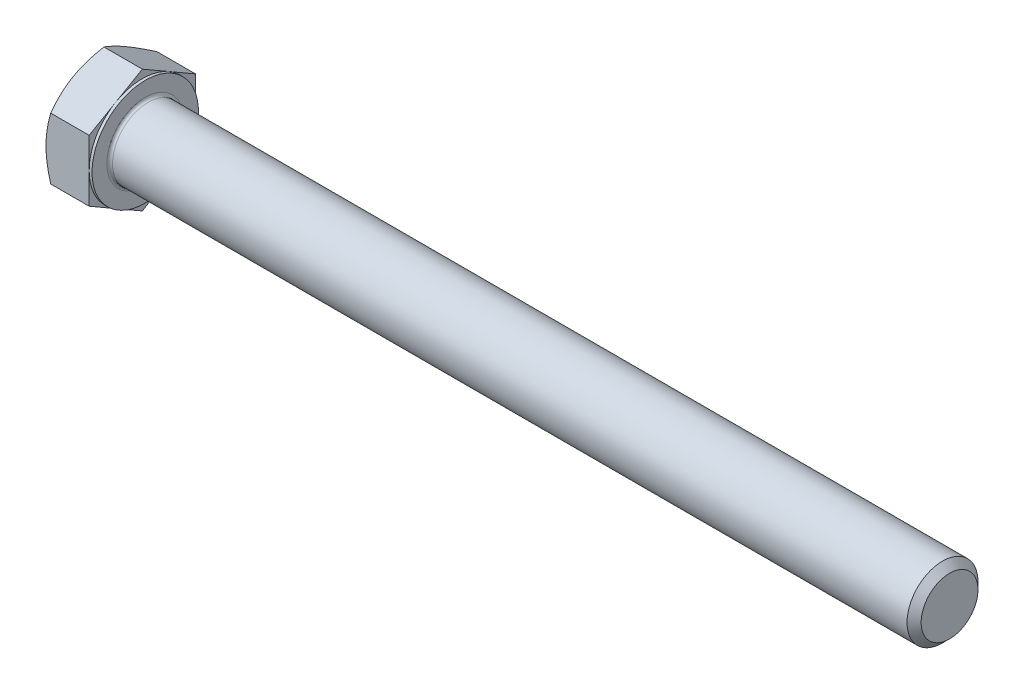
ISO-10303-21;
HEADER;
FILE_DESCRIPTION(('STEP AP214'),'2;1');
FILE_NAME('part.step','',(''),(''),'','','');
FILE_SCHEMA(('AUTOMOTIVE_DESIGN { 1 0 10303 214 1 1 1 1 }'));
ENDSEC;
DATA;
#1=APPLICATION_CONTEXT('core data for automotive mechanical design processes');
#2=APPLICATION_PROTOCOL_DEFINITION('international standard','automotive_design',2000,#1);
#3=PRODUCT_CONTEXT('',#1,'mechanical');
#4=PRODUCT('Part','Part','',(#3));
#5=PRODUCT_RELATED_PRODUCT_CATEGORY('part','',(#4));
#6=PRODUCT_DEFINITION_FORMATION('','',#4);
#7=PRODUCT_DEFINITION_CONTEXT('part definition',#1,'design');
#8=PRODUCT_DEFINITION('design','',#6,#7);
#9=PRODUCT_DEFINITION_SHAPE('','',#8);
#10=(LENGTH_UNIT() NAMED_UNIT(*) SI_UNIT(.MILLI.,.METRE.));
#11=(NAMED_UNIT(*) PLANE_ANGLE_UNIT() SI_UNIT($,.RADIAN.));
#12=(NAMED_UNIT(*) SI_UNIT($,.STERADIAN.) SOLID_ANGLE_UNIT());
#13=UNCERTAINTY_MEASURE_WITH_UNIT(LENGTH_MEASURE(1.E-05),#10,'distance_accuracy_value','');
#14=(GEOMETRIC_REPRESENTATION_CONTEXT(3) GLOBAL_UNCERTAINTY_ASSIGNED_CONTEXT((#13)) GLOBAL_UNIT_ASSIGNED_CONTEXT((#10,
#11,#12)) REPRESENTATION_CONTEXT('',''));
#15=CARTESIAN_POINT('',(0.,0.,0.));
#16=DIRECTION('',(0.,0.,1.));
#17=DIRECTION('',(1.,0.,0.));
#18=AXIS2_PLACEMENT_3D('',#15,#16,#17);
#19=CARTESIAN_POINT('',(0.,8.24155962262808,0.));
#20=DIRECTION('',(1.,0.,0.));
#21=DIRECTION('',(0.,0.,-1.));
#22=AXIS2_PLACEMENT_3D('',#19,#20,#21);
#23=PLANE('',#22);
#24=CARTESIAN_POINT('',(0.,0.,0.));
#25=DIRECTION('',(1.,0.,0.));
#26=DIRECTION('',(0.,0.,-1.));
#27=AXIS2_PLACEMENT_3D('',#24,#25,#26);
#28=CIRCLE('',#27,7.1374);
#29=CARTESIAN_POINT('',(0.,-6.18116971697105,-3.56870000000001));
#30=VERTEX_POINT('',#29);
#31=CARTESIAN_POINT('',(0.,0.,-7.1374));
#32=VERTEX_POINT('',#31);
#33=EDGE_CURVE('E111',#30,#32,#28,.T.);
#34=ORIENTED_EDGE('',*,*,#33,.F.);
#35=CARTESIAN_POINT('',(0.,0.,0.));
#36=DIRECTION('',(1.,0.,0.));
#37=DIRECTION('',(0.,0.,-1.));
#38=AXIS2_PLACEMENT_3D('',#35,#36,#37);
#39=CIRCLE('',#38,7.1374);
#40=CARTESIAN_POINT('',(0.,-6.18116971697106,3.56870000000001));
#41=VERTEX_POINT('',#40);
#42=EDGE_CURVE('E108',#41,#30,#39,.T.);
#43=ORIENTED_EDGE('',*,*,#42,.F.);
#44=CARTESIAN_POINT('',(0.,0.,0.));
#45=DIRECTION('',(1.,0.,0.));
#46=DIRECTION('',(0.,0.,-1.));
#47=AXIS2_PLACEMENT_3D('',#44,#45,#46);
#48=CIRCLE('',#47,7.1374);
#49=CARTESIAN_POINT('',(0.,0.,7.1374));
#50=VERTEX_POINT('',#49);
#51=EDGE_CURVE('E423',#50,#41,#48,.T.);
#52=ORIENTED_EDGE('',*,*,#51,.F.);
#53=CARTESIAN_POINT('',(0.,0.,0.));
#54=DIRECTION('',(1.,0.,0.));
#55=DIRECTION('',(0.,0.,-1.));
#56=AXIS2_PLACEMENT_3D('',#53,#54,#55);
#57=CIRCLE('',#56,7.1374);
#58=CARTESIAN_POINT('',(0.,6.18116971697105,3.56870000000001));
#59=VERTEX_POINT('',#58);
#60=EDGE_CURVE('E169',#59,#50,#57,.T.);
#61=ORIENTED_EDGE('',*,*,#60,.F.);
#62=CARTESIAN_POINT('',(0.,0.,0.));
#63=DIRECTION('',(1.,0.,0.));
#64=DIRECTION('',(0.,0.,-1.));
#65=AXIS2_PLACEMENT_3D('',#62,#63,#64);
#66=CIRCLE('',#65,7.1374);
#67=CARTESIAN_POINT('',(0.,6.18116971697105,-3.56870000000001));
#68=VERTEX_POINT('',#67);
#69=EDGE_CURVE('E421',#68,#59,#66,.T.);
#70=ORIENTED_EDGE('',*,*,#69,.F.);
#71=CARTESIAN_POINT('',(0.,0.,0.));
#72=DIRECTION('',(1.,0.,0.));
#73=DIRECTION('',(0.,0.,-1.));
#74=AXIS2_PLACEMENT_3D('',#71,#72,#73);
#75=CIRCLE('',#74,7.1374);
#76=EDGE_CURVE('E114',#32,#68,#75,.T.);
#77=ORIENTED_EDGE('',*,*,#76,.F.);
#78=EDGE_LOOP('',(#34,#43,#52,#61,#70,#77));
#79=FACE_BOUND('',#78,.T.);
#80=ADVANCED_FACE('F14',(#79),#23,.F.);
#81=CARTESIAN_POINT('',(0.641311776484754,0.,0.));
#82=DIRECTION('',(1.,0.,0.));
#83=DIRECTION('',(0.,0.,-1.));
#84=AXIS2_PLACEMENT_3D('',#81,#82,#83);
#85=CONICAL_SURFACE('',#84,8.24818458036387,1.0471975511966);
#86=ORIENTED_EDGE('',*,*,#42,.T.);
#87=CARTESIAN_POINT('',(0.,-6.18116971697106,-3.56870000000002));
#88=CARTESIAN_POINT('',(-2.91702878281906E-05,-6.26862170985652,-3.41722870509925));
#89=CARTESIAN_POINT('',(0.00371114889844038,-6.35606948988297,-3.26576470708432));
#90=CARTESIAN_POINT('',(0.0185139577467835,-6.53079334497843,-2.9631341127647));
#91=CARTESIAN_POINT('',(0.0295749978503088,-6.61806945060963,-2.81196746352471));
#92=CARTESIAN_POINT('',(0.0587296036169501,-6.7918862225359,-2.5109079833408));
#93=CARTESIAN_POINT('',(0.0767877659737066,-6.87842838481195,-2.3610125612818));
#94=CARTESIAN_POINT('',(0.119548178265526,-7.05110039256495,-2.06193587080869));
#95=CARTESIAN_POINT('',(0.144250603082628,-7.13723022712836,-1.91275462129736));
#96=CARTESIAN_POINT('',(0.227561148311189,-7.39464422393007,-1.46690050025742));
#97=CARTESIAN_POINT('',(0.295412992760169,-7.56518058886256,-1.17152285165624));
#98=CARTESIAN_POINT('',(0.451896700790797,-7.90478678087675,-0.583307672522674));
#99=CARTESIAN_POINT('',(0.540632343376944,-8.07384476218822,-0.290490659466179));
#100=CARTESIAN_POINT('',(0.637486855352638,-8.2415596226281,0.));
#101=B_SPLINE_CURVE_WITH_KNOTS('',3,(#87,#88,#89,#90,#91,#92,#93,#94,#95,#96,#97,#98,#99,#100),
.UNSPECIFIED.,.F.,.F.,(4,2,2,2,2,2,4),(0.,0.524658409500519,1.04921296370403,1.5711473776056,
2.09309553056225,3.13562382142666,4.18344647054619),.UNSPECIFIED.);
#102=CARTESIAN_POINT('',(0.637486855352637,-8.2415596226281,0.));
#103=VERTEX_POINT('',#102);
#104=EDGE_CURVE('E126',#30,#103,#101,.T.);
#105=ORIENTED_EDGE('',*,*,#104,.T.);
#106=CARTESIAN_POINT('',(0.637486855352637,-8.2415596226281,0.));
#107=CARTESIAN_POINT('',(0.540632343376944,-8.07384476218822,0.290490659466181));
#108=CARTESIAN_POINT('',(0.451896700790797,-7.90478678087675,0.583307672522676));
#109=CARTESIAN_POINT('',(0.295412992760169,-7.56518058886257,1.17152285165624));
#110=CARTESIAN_POINT('',(0.227561148311189,-7.39464422393008,1.46690050025742));
#111=CARTESIAN_POINT('',(0.14425060308263,-7.13723022712836,1.91275462129736));
#112=CARTESIAN_POINT('',(0.119548178265528,-7.05110039256495,2.06193587080869));
#113=CARTESIAN_POINT('',(0.0767877659737086,-6.87842838481196,2.3610125612818));
#114=CARTESIAN_POINT('',(0.0587296036169518,-6.7918862225359,2.5109079833408));
#115=CARTESIAN_POINT('',(0.0295749978503104,-6.61806945060963,2.81196746352471));
#116=CARTESIAN_POINT('',(0.0185139577467855,-6.53079334497843,2.9631341127647));
#117=CARTESIAN_POINT('',(0.00371114889844278,-6.35606948988298,3.26576470708432));
#118=CARTESIAN_POINT('',(-2.91702878256121E-05,-6.26862170985652,3.41722870509925));
#119=CARTESIAN_POINT('',(0.,-6.18116971697107,3.56870000000002));
#120=B_SPLINE_CURVE_WITH_KNOTS('',3,(#106,#107,#108,#109,#110,#111,#112,#113,#114,#115,#116,
#117,#118,#119),.UNSPECIFIED.,.F.,.F.,(4,2,2,2,2,2,4),(0.,1.04782264911953,2.09035093998394,
2.61229909294058,3.13423350684215,3.65878806104566,4.18344647054618),.UNSPECIFIED.);
#121=EDGE_CURVE('E132',#103,#41,#120,.T.);
#122=ORIENTED_EDGE('',*,*,#121,.T.);
#123=EDGE_LOOP('',(#86,#105,#122));
#124=FACE_BOUND('',#123,.T.);
#125=ADVANCED_FACE('F130',(#124),#85,.T.);
#126=CARTESIAN_POINT('',(0.641311776484743,0.,0.));
#127=DIRECTION('',(1.,0.,0.));
#128=DIRECTION('',(0.,0.,-1.));
#129=AXIS2_PLACEMENT_3D('',#126,#127,#128);
#130=CONICAL_SURFACE('',#129,8.24818458036385,1.0471975511966);
#131=ORIENTED_EDGE('',*,*,#33,.T.);
#132=CARTESIAN_POINT('',(0.,0.,-7.1374));
#133=CARTESIAN_POINT('',(-2.91702878363875E-05,-0.174903985770917,-7.1374));
#134=CARTESIAN_POINT('',(0.0037111488984321,-0.349799545823828,-7.1374));
#135=CARTESIAN_POINT('',(0.0185139577467752,-0.699247256014727,-7.1374));
#136=CARTESIAN_POINT('',(0.0295749978503004,-0.873799467277128,-7.1374));
#137=CARTESIAN_POINT('',(0.0587296036169417,-1.22143301112966,-7.1374));
#138=CARTESIAN_POINT('',(0.0767877659736981,-1.39451733568178,-7.1374));
#139=CARTESIAN_POINT('',(0.119548178265518,-1.73986135118776,-7.1374));
#140=CARTESIAN_POINT('',(0.144250603082619,-1.91212102031459,-7.1374));
#141=CARTESIAN_POINT('',(0.227561148311179,-2.42694901391801,-7.1374));
#142=CARTESIAN_POINT('',(0.295412992760159,-2.76802174378299,-7.1374));
#143=CARTESIAN_POINT('',(0.451896700790786,-3.44723412781136,-7.1374));
#144=CARTESIAN_POINT('',(0.540632343376933,-3.7853500904343,-7.1374));
#145=CARTESIAN_POINT('',(0.637486855352627,-4.12077981131404,-7.1374));
#146=B_SPLINE_CURVE_WITH_KNOTS('',3,(#132,#133,#134,#135,#136,#137,#138,#139,#140,#141,#142,
#143,#144,#145),.UNSPECIFIED.,.F.,.F.,(4,2,2,2,2,2,4),(0.,0.524658409500517,1.04921296370403,
1.5711473776056,2.09309553056224,3.13562382142665,4.18344647054617),.UNSPECIFIED.);
#147=CARTESIAN_POINT('',(0.637486855352626,-4.12077981131404,-7.1374));
#148=VERTEX_POINT('',#147);
#149=EDGE_CURVE('E122',#32,#148,#146,.T.);
#150=ORIENTED_EDGE('',*,*,#149,.T.);
#151=CARTESIAN_POINT('',(0.637486855352626,-4.12077981131404,-7.1374));
#152=CARTESIAN_POINT('',(0.540632343376933,-4.28849467175391,-6.84690934053382));
#153=CARTESIAN_POINT('',(0.451896700790788,-4.45755265306538,-6.55409232747733));
#154=CARTESIAN_POINT('',(0.295412992760162,-4.79715884507957,-5.96587714834377));
#155=CARTESIAN_POINT('',(0.227561148311183,-4.96769521001206,-5.6704994997426));
#156=CARTESIAN_POINT('',(0.144250603082625,-5.22510920681377,-5.22464537870266));
#157=CARTESIAN_POINT('',(0.119548178265524,-5.31123904137718,-5.07546412919133));
#158=CARTESIAN_POINT('',(0.076787765973705,-5.48391104913017,-4.77638743871822));
#159=CARTESIAN_POINT('',(0.0587296036169484,-5.57045321140623,-4.62649201665922));
#160=CARTESIAN_POINT('',(0.0295749978503076,-5.7442699833325,-4.32543253647532));
#161=CARTESIAN_POINT('',(0.0185139577467831,-5.8315460889637,-4.17426588723533));
#162=CARTESIAN_POINT('',(0.00371114889844091,-6.00626994405915,-3.87163529291571));
#163=CARTESIAN_POINT('',(-2.91702878274496E-05,-6.0937177240856,-3.72017129490078));
#164=CARTESIAN_POINT('',(0.,-6.18116971697106,-3.56870000000002));
#165=B_SPLINE_CURVE_WITH_KNOTS('',3,(#151,#152,#153,#154,#155,#156,#157,#158,#159,#160,#161,
#162,#163,#164),.UNSPECIFIED.,.F.,.F.,(4,2,2,2,2,2,4),(0.,1.04782264911952,2.09035093998392,
2.61229909294056,3.13423350684212,3.65878806104563,4.18344647054614),.UNSPECIFIED.);
#166=EDGE_CURVE('E120',#148,#30,#165,.T.);
#167=ORIENTED_EDGE('',*,*,#166,.T.);
#168=EDGE_LOOP('',(#131,#150,#167));
#169=FACE_BOUND('',#168,.T.);
#170=ADVANCED_FACE('F121',(#169),#130,.T.);
#171=CARTESIAN_POINT('',(0.641311776484739,0.,0.));
#172=DIRECTION('',(1.,0.,0.));
#173=DIRECTION('',(0.,0.,-1.));
#174=AXIS2_PLACEMENT_3D('',#171,#172,#173);
#175=CONICAL_SURFACE('',#174,8.24818458036384,1.0471975511966);
#176=CARTESIAN_POINT('',(0.637486855352624,4.12077981131404,-7.1374));
#177=CARTESIAN_POINT('',(0.540632343376931,3.78535009043429,-7.1374));
#178=CARTESIAN_POINT('',(0.451896700790785,3.44723412781136,-7.1374));
#179=CARTESIAN_POINT('',(0.295412992760157,2.76802174378299,-7.1374));
#180=CARTESIAN_POINT('',(0.227561148311177,2.42694901391801,-7.1374));
#181=CARTESIAN_POINT('',(0.144250603082619,1.91212102031458,-7.1374));
#182=CARTESIAN_POINT('',(0.119548178265517,1.73986135118776,-7.1374));
#183=CARTESIAN_POINT('',(0.076787765973698,1.39451733568178,-7.1374));
#184=CARTESIAN_POINT('',(0.0587296036169412,1.22143301112966,-7.1374));
#185=CARTESIAN_POINT('',(0.0295749978502998,0.873799467277126,-7.1374));
#186=CARTESIAN_POINT('',(0.018513957746775,0.699247256014726,-7.1374));
#187=CARTESIAN_POINT('',(0.0037111488984325,0.349799545823827,-7.1374));
#188=CARTESIAN_POINT('',(-2.91702878357943E-05,0.174903985770916,-7.1374));
#189=CARTESIAN_POINT('',(0.,0.,-7.1374));
#190=B_SPLINE_CURVE_WITH_KNOTS('',3,(#176,#177,#178,#179,#180,#181,#182,#183,#184,#185,#186,
#187,#188,#189),.UNSPECIFIED.,.F.,.F.,(4,2,2,2,2,2,4),(0.,1.04782264911952,2.09035093998393,
2.61229909294057,3.13423350684214,3.65878806104565,4.18344647054616),.UNSPECIFIED.);
#191=CARTESIAN_POINT('',(0.637486855352624,4.12077981131404,-7.1374));
#192=VERTEX_POINT('',#191);
#193=EDGE_CURVE('E140',#192,#32,#190,.T.);
#194=ORIENTED_EDGE('',*,*,#193,.T.);
#195=ORIENTED_EDGE('',*,*,#76,.T.);
#196=CARTESIAN_POINT('',(0.,6.18116971697105,-3.56870000000001));
#197=CARTESIAN_POINT('',(-2.9170287832926E-05,6.0937177240856,-3.72017129490077));
#198=CARTESIAN_POINT('',(0.00371114889843545,6.00626994405914,-3.8716352929157));
#199=CARTESIAN_POINT('',(0.018513957746778,5.83154608896369,-4.17426588723532));
#200=CARTESIAN_POINT('',(0.0295749978503029,5.74426998333249,-4.32543253647531));
#201=CARTESIAN_POINT('',(0.0587296036169437,5.57045321140622,-4.62649201665922));
#202=CARTESIAN_POINT('',(0.0767877659737001,5.48391104913017,-4.77638743871822));
#203=CARTESIAN_POINT('',(0.119548178265519,5.31123904137718,-5.07546412919132));
#204=CARTESIAN_POINT('',(0.144250603082621,5.22510920681376,-5.22464537870265));
#205=CARTESIAN_POINT('',(0.22756114831118,4.96769521001205,-5.67049949974259));
#206=CARTESIAN_POINT('',(0.295412992760159,4.79715884507956,-5.96587714834377));
#207=CARTESIAN_POINT('',(0.451896700790785,4.45755265306538,-6.55409232747733));
#208=CARTESIAN_POINT('',(0.540632343376931,4.28849467175391,-6.84690934053382));
#209=CARTESIAN_POINT('',(0.637486855352624,4.12077981131404,-7.1374));
#210=B_SPLINE_CURVE_WITH_KNOTS('',3,(#196,#197,#198,#199,#200,#201,#202,#203,#204,#205,#206,
#207,#208,#209),.UNSPECIFIED.,.F.,.F.,(4,2,2,2,2,2,4),(0.,0.524658409500515,1.04921296370402,
1.57114737760559,2.09309553056223,3.13562382142663,4.18344647054615),.UNSPECIFIED.);
#211=EDGE_CURVE('E246',#68,#192,#210,.T.);
#212=ORIENTED_EDGE('',*,*,#211,.T.);
#213=EDGE_LOOP('',(#194,#195,#212));
#214=FACE_BOUND('',#213,.T.);
#215=ADVANCED_FACE('F236',(#214),#175,.T.);
#216=CARTESIAN_POINT('',(0.641311776484745,0.,0.));
#217=DIRECTION('',(1.,0.,0.));
#218=DIRECTION('',(0.,0.,-1.));
#219=AXIS2_PLACEMENT_3D('',#216,#217,#218);
#220=CONICAL_SURFACE('',#219,8.24818458036385,1.0471975511966);
#221=CARTESIAN_POINT('',(0.637486855352629,8.24155962262808,0.));
#222=CARTESIAN_POINT('',(0.540632343376936,8.07384476218821,-0.290490659466181));
#223=CARTESIAN_POINT('',(0.45189670079079,7.90478678087674,-0.583307672522675));
#224=CARTESIAN_POINT('',(0.295412992760162,7.56518058886255,-1.17152285165624));
#225=CARTESIAN_POINT('',(0.227561148311182,7.39464422393006,-1.46690050025742));
#226=CARTESIAN_POINT('',(0.144250603082622,7.13723022712835,-1.91275462129736));
#227=CARTESIAN_POINT('',(0.119548178265521,7.05110039256494,-2.06193587080869));
#228=CARTESIAN_POINT('',(0.076787765973701,6.87842838481194,-2.3610125612818));
#229=CARTESIAN_POINT('',(0.0587296036169442,6.79188622253589,-2.5109079833408));
#230=CARTESIAN_POINT('',(0.0295749978503029,6.61806945060962,-2.81196746352471));
#231=CARTESIAN_POINT('',(0.018513957746778,6.53079334497842,-2.96313411276469));
#232=CARTESIAN_POINT('',(0.00371114889843529,6.35606948988297,-3.26576470708432));
#233=CARTESIAN_POINT('',(-2.91702878331806E-05,6.26862170985651,-3.41722870509924));
#234=CARTESIAN_POINT('',(0.,6.18116971697105,-3.56870000000001));
#235=B_SPLINE_CURVE_WITH_KNOTS('',3,(#221,#222,#223,#224,#225,#226,#227,#228,#229,#230,#231,
#232,#233,#234),.UNSPECIFIED.,.F.,.F.,(4,2,2,2,2,2,4),(0.,1.04782264911952,2.09035093998393,
2.61229909294058,3.13423350684215,3.65878806104566,4.18344647054617),.UNSPECIFIED.);
#236=CARTESIAN_POINT('',(0.637486855352629,8.24155962262808,0.));
#237=VERTEX_POINT('',#236);
#238=EDGE_CURVE('E241',#237,#68,#235,.T.);
#239=ORIENTED_EDGE('',*,*,#238,.T.);
#240=ORIENTED_EDGE('',*,*,#69,.T.);
#241=CARTESIAN_POINT('',(0.,6.18116971697105,3.56870000000001));
#242=CARTESIAN_POINT('',(-2.9170287834756E-05,6.26862170985651,3.41722870509925));
#243=CARTESIAN_POINT('',(0.00371114889843365,6.35606948988296,3.26576470708432));
#244=CARTESIAN_POINT('',(0.018513957746776,6.53079334497841,2.9631341127647));
#245=CARTESIAN_POINT('',(0.0295749978503007,6.61806945060961,2.81196746352471));
#246=CARTESIAN_POINT('',(0.0587296036169419,6.79188622253588,2.5109079833408));
#247=CARTESIAN_POINT('',(0.0767877659736988,6.87842838481194,2.3610125612818));
#248=CARTESIAN_POINT('',(0.119548178265519,7.05110039256493,2.06193587080869));
#249=CARTESIAN_POINT('',(0.14425060308262,7.13723022712835,1.91275462129736));
#250=CARTESIAN_POINT('',(0.22756114831118,7.39464422393006,1.46690050025742));
#251=CARTESIAN_POINT('',(0.295412992760161,7.56518058886255,1.17152285165624));
#252=CARTESIAN_POINT('',(0.451896700790789,7.90478678087674,0.583307672522675));
#253=CARTESIAN_POINT('',(0.540632343376935,8.07384476218821,0.29049065946618));
#254=CARTESIAN_POINT('',(0.637486855352629,8.24155962262808,0.));
#255=B_SPLINE_CURVE_WITH_KNOTS('',3,(#241,#242,#243,#244,#245,#246,#247,#248,#249,#250,#251,
#252,#253,#254),.UNSPECIFIED.,.F.,.F.,(4,2,2,2,2,2,4),(0.,0.524658409500518,1.04921296370403,
1.5711473776056,2.09309553056224,3.13562382142665,4.18344647054618),.UNSPECIFIED.);
#256=EDGE_CURVE('E228',#59,#237,#255,.T.);
#257=ORIENTED_EDGE('',*,*,#256,.T.);
#258=EDGE_LOOP('',(#239,#240,#257));
#259=FACE_BOUND('',#258,.T.);
#260=ADVANCED_FACE('F233',(#259),#220,.T.);
#261=CARTESIAN_POINT('',(0.641311776484745,0.,0.));
#262=DIRECTION('',(1.,0.,0.));
#263=DIRECTION('',(0.,0.,-1.));
#264=AXIS2_PLACEMENT_3D('',#261,#262,#263);
#265=CONICAL_SURFACE('',#264,8.24818458036385,1.0471975511966);
#266=ORIENTED_EDGE('',*,*,#51,.T.);
#267=CARTESIAN_POINT('',(0.,-6.18116971697107,3.56870000000002));
#268=CARTESIAN_POINT('',(-2.9170287825595E-05,-6.09371772408561,3.72017129490078));
#269=CARTESIAN_POINT('',(0.00371114889844298,-6.00626994405915,3.87163529291571));
#270=CARTESIAN_POINT('',(0.0185139577467859,-5.8315460889637,4.17426588723533));
#271=CARTESIAN_POINT('',(0.0295749978503109,-5.7442699833325,4.32543253647531));
#272=CARTESIAN_POINT('',(0.0587296036169516,-5.57045321140624,4.62649201665922));
#273=CARTESIAN_POINT('',(0.0767877659737078,-5.48391104913018,4.77638743871822));
#274=CARTESIAN_POINT('',(0.119548178265527,-5.31123904137719,5.07546412919133));
#275=CARTESIAN_POINT('',(0.144250603082628,-5.22510920681378,5.22464537870266));
#276=CARTESIAN_POINT('',(0.227561148311187,-4.96769521001206,5.6704994997426));
#277=CARTESIAN_POINT('',(0.295412992760166,-4.79715884507958,5.96587714834377));
#278=CARTESIAN_POINT('',(0.451896700790791,-4.45755265306539,6.55409232747733));
#279=CARTESIAN_POINT('',(0.540632343376936,-4.28849467175392,6.84690934053382));
#280=CARTESIAN_POINT('',(0.637486855352629,-4.12077981131405,7.1374));
#281=B_SPLINE_CURVE_WITH_KNOTS('',3,(#267,#268,#269,#270,#271,#272,#273,#274,#275,#276,#277,
#278,#279,#280),.UNSPECIFIED.,.F.,.F.,(4,2,2,2,2,2,4),(0.,0.524658409500513,1.04921296370402,
1.57114737760559,2.09309553056223,3.13562382142663,4.18344647054615),.UNSPECIFIED.);
#282=CARTESIAN_POINT('',(0.637486855352629,-4.12077981131405,7.1374));
#283=VERTEX_POINT('',#282);
#284=EDGE_CURVE('E127',#41,#283,#281,.T.);
#285=ORIENTED_EDGE('',*,*,#284,.T.);
#286=CARTESIAN_POINT('',(0.637486855352629,-4.12077981131405,7.1374));
#287=CARTESIAN_POINT('',(0.540632343376935,-3.78535009043431,7.1374));
#288=CARTESIAN_POINT('',(0.451896700790788,-3.44723412781137,7.1374));
#289=CARTESIAN_POINT('',(0.29541299276016,-2.768021743783,7.1374));
#290=CARTESIAN_POINT('',(0.22756114831118,-2.42694901391802,7.1374));
#291=CARTESIAN_POINT('',(0.14425060308262,-1.91212102031459,7.1374));
#292=CARTESIAN_POINT('',(0.119548178265519,-1.73986135118776,7.1374));
#293=CARTESIAN_POINT('',(0.0767877659736989,-1.39451733568178,7.1374));
#294=CARTESIAN_POINT('',(0.0587296036169421,-1.22143301112967,7.1374));
#295=CARTESIAN_POINT('',(0.0295749978503008,-0.87379946727713,7.1374));
#296=CARTESIAN_POINT('',(0.018513957746776,-0.699247256014728,7.1374));
#297=CARTESIAN_POINT('',(0.00371114889843334,-0.349799545823828,7.1374));
#298=CARTESIAN_POINT('',(-2.91702878350887E-05,-0.174903985770916,7.1374));
#299=CARTESIAN_POINT('',(0.,0.,7.1374));
#300=B_SPLINE_CURVE_WITH_KNOTS('',3,(#286,#287,#288,#289,#290,#291,#292,#293,#294,#295,#296,
#297,#298,#299),.UNSPECIFIED.,.F.,.F.,(4,2,2,2,2,2,4),(0.,1.04782264911953,2.09035093998394,
2.61229909294058,3.13423350684215,3.65878806104566,4.18344647054618),.UNSPECIFIED.);
#301=EDGE_CURVE('E206',#283,#50,#300,.T.);
#302=ORIENTED_EDGE('',*,*,#301,.T.);
#303=EDGE_LOOP('',(#266,#285,#302));
#304=FACE_BOUND('',#303,.T.);
#305=ADVANCED_FACE('F184',(#304),#265,.T.);
#306=CARTESIAN_POINT('',(0.641311776484738,0.,0.));
#307=DIRECTION('',(1.,0.,0.));
#308=DIRECTION('',(0.,0.,-1.));
#309=AXIS2_PLACEMENT_3D('',#306,#307,#308);
#310=CONICAL_SURFACE('',#309,8.24818458036384,1.0471975511966);
#311=CARTESIAN_POINT('',(0.637486855352622,4.12077981131403,7.1374));
#312=CARTESIAN_POINT('',(0.540632343376929,4.2884946717539,6.84690934053382));
#313=CARTESIAN_POINT('',(0.451896700790783,4.45755265306537,6.55409232747733));
#314=CARTESIAN_POINT('',(0.295412992760157,4.79715884507955,5.96587714834377));
#315=CARTESIAN_POINT('',(0.227561148311178,4.96769521001204,5.67049949974259));
#316=CARTESIAN_POINT('',(0.144250603082619,5.22510920681376,5.22464537870266));
#317=CARTESIAN_POINT('',(0.119548178265518,5.31123904137717,5.07546412919132));
#318=CARTESIAN_POINT('',(0.0767877659736985,5.48391104913016,4.77638743871822));
#319=CARTESIAN_POINT('',(0.0587296036169418,5.57045321140622,4.62649201665922));
#320=CARTESIAN_POINT('',(0.0295749978503007,5.74426998333248,4.32543253647531));
#321=CARTESIAN_POINT('',(0.0185139577467759,5.83154608896368,4.17426588723532));
#322=CARTESIAN_POINT('',(0.00371114889843337,6.00626994405913,3.8716352929157));
#323=CARTESIAN_POINT('',(-2.91702878350612E-05,6.09371772408559,3.72017129490078));
#324=CARTESIAN_POINT('',(0.,6.18116971697105,3.56870000000001));
#325=B_SPLINE_CURVE_WITH_KNOTS('',3,(#311,#312,#313,#314,#315,#316,#317,#318,#319,#320,#321,
#322,#323,#324),.UNSPECIFIED.,.F.,.F.,(4,2,2,2,2,2,4),(0.,1.04782264911952,2.09035093998392,
2.61229909294056,3.13423350684213,3.65878806104564,4.18344647054615),.UNSPECIFIED.);
#326=CARTESIAN_POINT('',(0.637486855352622,4.12077981131403,7.1374));
#327=VERTEX_POINT('',#326);
#328=EDGE_CURVE('E190',#327,#59,#325,.T.);
#329=ORIENTED_EDGE('',*,*,#328,.T.);
#330=ORIENTED_EDGE('',*,*,#60,.T.);
#331=CARTESIAN_POINT('',(0.,0.,7.1374));
#332=CARTESIAN_POINT('',(-2.91702878350349E-05,0.174903985770917,7.1374));
#333=CARTESIAN_POINT('',(0.00371114889843339,0.349799545823827,7.1374));
#334=CARTESIAN_POINT('',(0.0185139577467758,0.699247256014725,7.1374));
#335=CARTESIAN_POINT('',(0.0295749978503005,0.873799467277125,7.1374));
#336=CARTESIAN_POINT('',(0.0587296036169414,1.22143301112966,7.1374));
#337=CARTESIAN_POINT('',(0.076787765973698,1.39451733568177,7.1374));
#338=CARTESIAN_POINT('',(0.119548178265517,1.73986135118775,7.1374));
#339=CARTESIAN_POINT('',(0.144250603082619,1.91212102031458,7.1374));
#340=CARTESIAN_POINT('',(0.227561148311177,2.426949013918,7.1374));
#341=CARTESIAN_POINT('',(0.295412992760157,2.76802174378298,7.1374));
#342=CARTESIAN_POINT('',(0.451896700790783,3.44723412781135,7.1374));
#343=CARTESIAN_POINT('',(0.540632343376929,3.78535009043429,7.1374));
#344=CARTESIAN_POINT('',(0.637486855352622,4.12077981131403,7.1374));
#345=B_SPLINE_CURVE_WITH_KNOTS('',3,(#331,#332,#333,#334,#335,#336,#337,#338,#339,#340,#341,
#342,#343,#344),.UNSPECIFIED.,.F.,.F.,(4,2,2,2,2,2,4),(0.,0.524658409500515,1.04921296370402,
1.57114737760559,2.09309553056223,3.13562382142663,4.18344647054615),.UNSPECIFIED.);
#346=EDGE_CURVE('E198',#50,#327,#345,.T.);
#347=ORIENTED_EDGE('',*,*,#346,.T.);
#348=EDGE_LOOP('',(#329,#330,#347));
#349=FACE_BOUND('',#348,.T.);
#350=ADVANCED_FACE('F179',(#349),#310,.T.);
#351=CARTESIAN_POINT('',(6.1722,-8.2415596226281,0.));
#352=DIRECTION('',(0.,0.866025403784438,-0.500000000000001));
#353=DIRECTION('',(0.,0.500000000000001,0.866025403784438));
#354=AXIS2_PLACEMENT_3D('',#351,#352,#353);
#355=PLANE('',#354);
#356=DIRECTION('',(-1.,0.,0.));
#357=VECTOR('',#356,1.);
#358=CARTESIAN_POINT('',(6.1722,-4.12077981131405,7.1374));
#359=LINE('',#358,#357);
#360=CARTESIAN_POINT('',(5.7912,-4.12077981131405,7.1374));
#361=VERTEX_POINT('',#360);
#362=EDGE_CURVE('E357',#361,#283,#359,.T.);
#363=ORIENTED_EDGE('',*,*,#362,.T.);
#364=ORIENTED_EDGE('',*,*,#284,.F.);
#365=ORIENTED_EDGE('',*,*,#121,.F.);
#366=DIRECTION('',(1.,0.,0.));
#367=VECTOR('',#366,1.);
#368=CARTESIAN_POINT('',(6.1722,-8.2415596226281,0.));
#369=LINE('',#368,#367);
#370=CARTESIAN_POINT('',(5.7912,-8.2415596226281,0.));
#371=VERTEX_POINT('',#370);
#372=EDGE_CURVE('E138',#103,#371,#369,.T.);
#373=ORIENTED_EDGE('',*,*,#372,.T.);
#374=DIRECTION('',(0.,-0.500000000000005,-0.866025403784436));
#375=VECTOR('',#374,1.);
#376=CARTESIAN_POINT('',(5.7912,-6.18116971697105,3.5687));
#377=LINE('',#376,#375);
#378=CARTESIAN_POINT('',(5.7912,-6.18116971697105,3.5687));
#379=VERTEX_POINT('',#378);
#380=EDGE_CURVE('E347',#379,#371,#377,.T.);
#381=ORIENTED_EDGE('',*,*,#380,.F.);
#382=DIRECTION('',(0.,-0.499999999999996,-0.866025403784441));
#383=VECTOR('',#382,1.);
#384=CARTESIAN_POINT('',(5.7912,-4.12077981131405,7.1374));
#385=LINE('',#384,#383);
#386=EDGE_CURVE('E350',#361,#379,#385,.T.);
#387=ORIENTED_EDGE('',*,*,#386,.F.);
#388=EDGE_LOOP('',(#363,#364,#365,#373,#381,#387));
#389=FACE_BOUND('',#388,.T.);
#390=ADVANCED_FACE('F175',(#389),#355,.F.);
#391=CARTESIAN_POINT('',(6.1722,-4.12077981131404,-7.1374));
#392=DIRECTION('',(0.,0.866025403784438,0.500000000000001));
#393=DIRECTION('',(0.,-0.500000000000001,0.866025403784438));
#394=AXIS2_PLACEMENT_3D('',#391,#392,#393);
#395=PLANE('',#394);
#396=ORIENTED_EDGE('',*,*,#372,.F.);
#397=ORIENTED_EDGE('',*,*,#104,.F.);
#398=ORIENTED_EDGE('',*,*,#166,.F.);
#399=DIRECTION('',(1.,0.,0.));
#400=VECTOR('',#399,1.);
#401=CARTESIAN_POINT('',(6.1722,-4.12077981131404,-7.1374));
#402=LINE('',#401,#400);
#403=CARTESIAN_POINT('',(5.7912,-4.12077981131404,-7.1374));
#404=VERTEX_POINT('',#403);
#405=EDGE_CURVE('E247',#148,#404,#402,.T.);
#406=ORIENTED_EDGE('',*,*,#405,.T.);
#407=DIRECTION('',(0.,0.499999999999998,-0.866025403784439));
#408=VECTOR('',#407,1.);
#409=CARTESIAN_POINT('',(5.7912,-6.18116971697105,-3.56870000000001));
#410=LINE('',#409,#408);
#411=CARTESIAN_POINT('',(5.7912,-6.18116971697104,-3.56870000000001));
#412=VERTEX_POINT('',#411);
#413=EDGE_CURVE('E341',#412,#404,#410,.T.);
#414=ORIENTED_EDGE('',*,*,#413,.F.);
#415=DIRECTION('',(0.,0.500000000000005,-0.866025403784436));
#416=VECTOR('',#415,1.);
#417=CARTESIAN_POINT('',(5.7912,-8.2415596226281,0.));
#418=LINE('',#417,#416);
#419=EDGE_CURVE('E344',#371,#412,#418,.T.);
#420=ORIENTED_EDGE('',*,*,#419,.F.);
#421=EDGE_LOOP('',(#396,#397,#398,#406,#414,#420));
#422=FACE_BOUND('',#421,.T.);
#423=ADVANCED_FACE('F136',(#422),#395,.F.);
#424=CARTESIAN_POINT('',(6.1722,4.12077981131404,-7.1374));
#425=DIRECTION('',(0.,0.,1.));
#426=DIRECTION('',(0.,-1.,0.));
#427=AXIS2_PLACEMENT_3D('',#424,#425,#426);
#428=PLANE('',#427);
#429=ORIENTED_EDGE('',*,*,#405,.F.);
#430=ORIENTED_EDGE('',*,*,#149,.F.);
#431=ORIENTED_EDGE('',*,*,#193,.F.);
#432=DIRECTION('',(1.,0.,0.));
#433=VECTOR('',#432,1.);
#434=CARTESIAN_POINT('',(6.1722,4.12077981131404,-7.1374));
#435=LINE('',#434,#433);
#436=CARTESIAN_POINT('',(5.7912,4.12077981131404,-7.1374));
#437=VERTEX_POINT('',#436);
#438=EDGE_CURVE('E361',#192,#437,#435,.T.);
#439=ORIENTED_EDGE('',*,*,#438,.T.);
#440=DIRECTION('',(0.,1.,0.));
#441=VECTOR('',#440,1.);
#442=CARTESIAN_POINT('',(5.7912,7.1374,-7.1374));
#443=LINE('',#442,#441);
#444=CARTESIAN_POINT('',(5.7912,0.,-7.1374));
#445=VERTEX_POINT('',#444);
#446=EDGE_CURVE('E332',#445,#437,#443,.T.);
#447=ORIENTED_EDGE('',*,*,#446,.F.);
#448=DIRECTION('',(0.,1.,0.));
#449=VECTOR('',#448,1.);
#450=CARTESIAN_POINT('',(5.7912,7.1374,-7.1374));
#451=LINE('',#450,#449);
#452=EDGE_CURVE('E338',#404,#445,#451,.T.);
#453=ORIENTED_EDGE('',*,*,#452,.F.);
#454=EDGE_LOOP('',(#429,#430,#431,#439,#447,#453));
#455=FACE_BOUND('',#454,.T.);
#456=ADVANCED_FACE('F254',(#455),#428,.F.);
#457=CARTESIAN_POINT('',(6.1722,4.12077981131404,-7.1374));
#458=DIRECTION('',(0.,-0.866025403784438,0.500000000000001));
#459=DIRECTION('',(0.,-0.500000000000001,-0.866025403784438));
#460=AXIS2_PLACEMENT_3D('',#457,#458,#459);
#461=PLANE('',#460);
#462=ORIENTED_EDGE('',*,*,#438,.F.);
#463=ORIENTED_EDGE('',*,*,#211,.F.);
#464=ORIENTED_EDGE('',*,*,#238,.F.);
#465=DIRECTION('',(1.,0.,0.));
#466=VECTOR('',#465,1.);
#467=CARTESIAN_POINT('',(6.1722,8.24155962262808,0.));
#468=LINE('',#467,#466);
#469=CARTESIAN_POINT('',(5.7912,8.24155962262808,0.));
#470=VERTEX_POINT('',#469);
#471=EDGE_CURVE('E232',#237,#470,#468,.T.);
#472=ORIENTED_EDGE('',*,*,#471,.T.);
#473=DIRECTION('',(0.,0.500000000000002,0.866025403784437));
#474=VECTOR('',#473,1.);
#475=CARTESIAN_POINT('',(5.7912,6.18116971697105,-3.56870000000001));
#476=LINE('',#475,#474);
#477=CARTESIAN_POINT('',(5.7912,6.18116971697105,-3.5687));
#478=VERTEX_POINT('',#477);
#479=EDGE_CURVE('E329',#478,#470,#476,.T.);
#480=ORIENTED_EDGE('',*,*,#479,.F.);
#481=DIRECTION('',(0.,0.5,0.866025403784439));
#482=VECTOR('',#481,1.);
#483=CARTESIAN_POINT('',(5.7912,4.12077981131404,-7.1374));
#484=LINE('',#483,#482);
#485=EDGE_CURVE('E335',#437,#478,#484,.T.);
#486=ORIENTED_EDGE('',*,*,#485,.F.);
#487=EDGE_LOOP('',(#462,#463,#464,#472,#480,#486));
#488=FACE_BOUND('',#487,.T.);
#489=ADVANCED_FACE('F224',(#488),#461,.F.);
#490=CARTESIAN_POINT('',(6.1722,8.24155962262808,0.));
#491=DIRECTION('',(0.,-0.866025403784438,-0.500000000000001));
#492=DIRECTION('',(0.,0.500000000000001,-0.866025403784438));
#493=AXIS2_PLACEMENT_3D('',#490,#491,#492);
#494=PLANE('',#493);
#495=ORIENTED_EDGE('',*,*,#471,.F.);
#496=ORIENTED_EDGE('',*,*,#256,.F.);
#497=ORIENTED_EDGE('',*,*,#328,.F.);
#498=DIRECTION('',(-1.,0.,0.));
#499=VECTOR('',#498,1.);
#500=CARTESIAN_POINT('',(6.1722,4.12077981131403,7.1374));
#501=LINE('',#500,#499);
#502=CARTESIAN_POINT('',(5.7912,4.12077981131403,7.1374));
#503=VERTEX_POINT('',#502);
#504=EDGE_CURVE('E205',#327,#503,#501,.F.);
#505=ORIENTED_EDGE('',*,*,#504,.T.);
#506=DIRECTION('',(0.,-0.500000000000001,0.866025403784438));
#507=VECTOR('',#506,1.);
#508=CARTESIAN_POINT('',(5.7912,6.18116971697105,3.56870000000001));
#509=LINE('',#508,#507);
#510=CARTESIAN_POINT('',(5.7912,6.18116971697104,3.56870000000001));
#511=VERTEX_POINT('',#510);
#512=EDGE_CURVE('E323',#511,#503,#509,.T.);
#513=ORIENTED_EDGE('',*,*,#512,.F.);
#514=DIRECTION('',(0.,-0.500000000000002,0.866025403784438));
#515=VECTOR('',#514,1.);
#516=CARTESIAN_POINT('',(5.7912,8.24155962262808,0.));
#517=LINE('',#516,#515);
#518=EDGE_CURVE('E326',#470,#511,#517,.T.);
#519=ORIENTED_EDGE('',*,*,#518,.F.);
#520=EDGE_LOOP('',(#495,#496,#497,#505,#513,#519));
#521=FACE_BOUND('',#520,.T.);
#522=ADVANCED_FACE('F217',(#521),#494,.F.);
#523=CARTESIAN_POINT('',(6.1722,4.12077981131403,7.1374));
#524=DIRECTION('',(0.,0.,-1.));
#525=DIRECTION('',(-1.,0.,0.));
#526=AXIS2_PLACEMENT_3D('',#523,#524,#525);
#527=PLANE('',#526);
#528=ORIENTED_EDGE('',*,*,#504,.F.);
#529=ORIENTED_EDGE('',*,*,#346,.F.);
#530=ORIENTED_EDGE('',*,*,#301,.F.);
#531=ORIENTED_EDGE('',*,*,#362,.F.);
#532=DIRECTION('',(0.,1.,0.));
#533=VECTOR('',#532,1.);
#534=CARTESIAN_POINT('',(5.7912,7.1374,7.1374));
#535=LINE('',#534,#533);
#536=CARTESIAN_POINT('',(5.7912,0.,7.1374));
#537=VERTEX_POINT('',#536);
#538=EDGE_CURVE('E353',#537,#361,#535,.F.);
#539=ORIENTED_EDGE('',*,*,#538,.F.);
#540=DIRECTION('',(0.,1.,0.));
#541=VECTOR('',#540,1.);
#542=CARTESIAN_POINT('',(5.7912,7.1374,7.1374));
#543=LINE('',#542,#541);
#544=EDGE_CURVE('E315',#503,#537,#543,.F.);
#545=ORIENTED_EDGE('',*,*,#544,.F.);
#546=EDGE_LOOP('',(#528,#529,#530,#531,#539,#545));
#547=FACE_BOUND('',#546,.T.);
#548=ADVANCED_FACE('F212',(#547),#527,.F.);
#549=CARTESIAN_POINT('',(5.7912,7.1374,0.));
#550=DIRECTION('',(1.,0.,0.));
#551=DIRECTION('',(0.,0.,-1.));
#552=AXIS2_PLACEMENT_3D('',#549,#550,#551);
#553=PLANE('',#552);
#554=ORIENTED_EDGE('',*,*,#386,.T.);
#555=CARTESIAN_POINT('',(5.7912,0.,0.));
#556=DIRECTION('',(-1.,0.,0.));
#557=DIRECTION('',(0.,0.,1.));
#558=AXIS2_PLACEMENT_3D('',#555,#556,#557);
#559=CIRCLE('',#558,7.1374);
#560=EDGE_CURVE('E207',#537,#379,#559,.F.);
#561=ORIENTED_EDGE('',*,*,#560,.F.);
#562=ORIENTED_EDGE('',*,*,#538,.T.);
#563=EDGE_LOOP('',(#554,#561,#562));
#564=FACE_BOUND('',#563,.T.);
#565=ADVANCED_FACE('F216',(#564),#553,.T.);
#566=CARTESIAN_POINT('',(5.7912,7.1374,0.));
#567=DIRECTION('',(1.,0.,0.));
#568=DIRECTION('',(0.,0.,-1.));
#569=AXIS2_PLACEMENT_3D('',#566,#567,#568);
#570=PLANE('',#569);
#571=ORIENTED_EDGE('',*,*,#419,.T.);
#572=CARTESIAN_POINT('',(5.7912,0.,0.));
#573=DIRECTION('',(-1.,0.,0.));
#574=DIRECTION('',(0.,0.,1.));
#575=AXIS2_PLACEMENT_3D('',#572,#573,#574);
#576=CIRCLE('',#575,7.1374);
#577=EDGE_CURVE('E381',#379,#412,#576,.F.);
#578=ORIENTED_EDGE('',*,*,#577,.F.);
#579=ORIENTED_EDGE('',*,*,#380,.T.);
#580=EDGE_LOOP('',(#571,#578,#579));
#581=FACE_BOUND('',#580,.T.);
#582=ADVANCED_FACE('F401',(#581),#570,.T.);
#583=CARTESIAN_POINT('',(5.7912,7.1374,0.));
#584=DIRECTION('',(1.,0.,0.));
#585=DIRECTION('',(0.,0.,-1.));
#586=AXIS2_PLACEMENT_3D('',#583,#584,#585);
#587=PLANE('',#586);
#588=ORIENTED_EDGE('',*,*,#452,.T.);
#589=CARTESIAN_POINT('',(5.7912,0.,0.));
#590=DIRECTION('',(-1.,0.,0.));
#591=DIRECTION('',(0.,0.,1.));
#592=AXIS2_PLACEMENT_3D('',#589,#590,#591);
#593=CIRCLE('',#592,7.1374);
#594=EDGE_CURVE('E379',#412,#445,#593,.F.);
#595=ORIENTED_EDGE('',*,*,#594,.F.);
#596=ORIENTED_EDGE('',*,*,#413,.T.);
#597=EDGE_LOOP('',(#588,#595,#596));
#598=FACE_BOUND('',#597,.T.);
#599=ADVANCED_FACE('F404',(#598),#587,.T.);
#600=CARTESIAN_POINT('',(5.7912,7.1374,0.));
#601=DIRECTION('',(1.,0.,0.));
#602=DIRECTION('',(0.,0.,-1.));
#603=AXIS2_PLACEMENT_3D('',#600,#601,#602);
#604=PLANE('',#603);
#605=CARTESIAN_POINT('',(5.7912,0.,0.));
#606=DIRECTION('',(-1.,0.,0.));
#607=DIRECTION('',(0.,0.,1.));
#608=AXIS2_PLACEMENT_3D('',#605,#606,#607);
#609=CIRCLE('',#608,7.1374);
#610=EDGE_CURVE('E376',#445,#478,#609,.F.);
#611=ORIENTED_EDGE('',*,*,#610,.F.);
#612=ORIENTED_EDGE('',*,*,#446,.T.);
#613=ORIENTED_EDGE('',*,*,#485,.T.);
#614=EDGE_LOOP('',(#611,#612,#613));
#615=FACE_BOUND('',#614,.T.);
#616=ADVANCED_FACE('F408',(#615),#604,.T.);
#617=CARTESIAN_POINT('',(5.7912,7.1374,0.));
#618=DIRECTION('',(1.,0.,0.));
#619=DIRECTION('',(0.,0.,-1.));
#620=AXIS2_PLACEMENT_3D('',#617,#618,#619);
#621=PLANE('',#620);
#622=ORIENTED_EDGE('',*,*,#518,.T.);
#623=CARTESIAN_POINT('',(5.7912,0.,0.));
#624=DIRECTION('',(-1.,0.,0.));
#625=DIRECTION('',(0.,0.,1.));
#626=AXIS2_PLACEMENT_3D('',#623,#624,#625);
#627=CIRCLE('',#626,7.1374);
#628=EDGE_CURVE('E373',#478,#511,#627,.F.);
#629=ORIENTED_EDGE('',*,*,#628,.F.);
#630=ORIENTED_EDGE('',*,*,#479,.T.);
#631=EDGE_LOOP('',(#622,#629,#630));
#632=FACE_BOUND('',#631,.T.);
#633=ADVANCED_FACE('F413',(#632),#621,.T.);
#634=CARTESIAN_POINT('',(5.7912,7.1374,0.));
#635=DIRECTION('',(1.,0.,0.));
#636=DIRECTION('',(0.,0.,-1.));
#637=AXIS2_PLACEMENT_3D('',#634,#635,#636);
#638=PLANE('',#637);
#639=ORIENTED_EDGE('',*,*,#544,.T.);
#640=CARTESIAN_POINT('',(5.7912,0.,0.));
#641=DIRECTION('',(-1.,0.,0.));
#642=DIRECTION('',(0.,0.,1.));
#643=AXIS2_PLACEMENT_3D('',#640,#641,#642);
#644=CIRCLE('',#643,7.1374);
#645=EDGE_CURVE('E370',#511,#537,#644,.F.);
#646=ORIENTED_EDGE('',*,*,#645,.F.);
#647=ORIENTED_EDGE('',*,*,#512,.T.);
#648=EDGE_LOOP('',(#639,#646,#647));
#649=FACE_BOUND('',#648,.T.);
#650=ADVANCED_FACE('F394',(#649),#638,.T.);
#651=CARTESIAN_POINT('',(0.,0.,0.));
#652=DIRECTION('',(-1.,0.,0.));
#653=DIRECTION('',(0.,0.,1.));
#654=AXIS2_PLACEMENT_3D('',#651,#652,#653);
#655=CYLINDRICAL_SURFACE('',#654,7.1374);
#656=ORIENTED_EDGE('',*,*,#594,.T.);
#657=ORIENTED_EDGE('',*,*,#610,.T.);
#658=ORIENTED_EDGE('',*,*,#628,.T.);
#659=ORIENTED_EDGE('',*,*,#645,.T.);
#660=ORIENTED_EDGE('',*,*,#560,.T.);
#661=ORIENTED_EDGE('',*,*,#577,.T.);
#662=EDGE_LOOP('',(#656,#657,#658,#659,#660,#661));
#663=FACE_BOUND('',#662,.T.);
#664=CARTESIAN_POINT('',(6.1722,0.,0.));
#665=DIRECTION('',(-1.,0.,0.));
#666=DIRECTION('',(0.,0.,1.));
#667=AXIS2_PLACEMENT_3D('',#664,#665,#666);
#668=CIRCLE('',#667,7.1374);
#669=CARTESIAN_POINT('',(6.1722,0.,7.1374));
#670=VERTEX_POINT('',#669);
#671=EDGE_CURVE('E367',#670,#670,#668,.F.);
#672=ORIENTED_EDGE('',*,*,#671,.F.);
#673=EDGE_LOOP('',(#672));
#674=FACE_BOUND('',#673,.T.);
#675=ADVANCED_FACE('F387',(#663,#674),#655,.T.);
#676=CARTESIAN_POINT('',(114.1222,0.,0.));
#677=DIRECTION('',(-1.,0.,0.));
#678=DIRECTION('',(0.,0.,1.));
#679=AXIS2_PLACEMENT_3D('',#676,#677,#678);
#680=PLANE('',#679);
#681=CARTESIAN_POINT('',(114.122199999997,0.,0.));
#682=DIRECTION('',(-1.,0.,0.));
#683=DIRECTION('',(0.,0.,1.));
#684=AXIS2_PLACEMENT_3D('',#681,#682,#683);
#685=CIRCLE('',#684,3.81635000002234);
#686=CARTESIAN_POINT('',(114.122199999997,0.,3.81635000002234));
#687=VERTEX_POINT('',#686);
#688=EDGE_CURVE('E364',#687,#687,#685,.T.);
#689=ORIENTED_EDGE('',*,*,#688,.F.);
#690=EDGE_LOOP('',(#689));
#691=FACE_BOUND('',#690,.T.);
#692=ADVANCED_FACE('F299',(#691),#680,.F.);
#693=CARTESIAN_POINT('',(6.1722,8.24155962262808,0.));
#694=DIRECTION('',(1.,0.,0.));
#695=DIRECTION('',(0.,0.,-1.));
#696=AXIS2_PLACEMENT_3D('',#693,#694,#695);
#697=PLANE('',#696);
#698=ORIENTED_EDGE('',*,*,#671,.T.);
#699=EDGE_LOOP('',(#698));
#700=FACE_BOUND('',#699,.T.);
#701=CARTESIAN_POINT('',(6.1722,0.,0.));
#702=DIRECTION('',(1.,0.,0.));
#703=DIRECTION('',(0.,0.,1.));
#704=AXIS2_PLACEMENT_3D('',#701,#702,#703);
#705=CIRCLE('',#704,5.1435);
#706=CARTESIAN_POINT('',(6.1722,0.,-5.1435));
#707=VERTEX_POINT('',#706);
#708=CARTESIAN_POINT('',(6.1722,0.,5.1435));
#709=VERTEX_POINT('',#708);
#710=EDGE_CURVE('E286',#707,#709,#705,.F.);
#711=ORIENTED_EDGE('',*,*,#710,.T.);
#712=CARTESIAN_POINT('',(6.1722,0.,0.));
#713=DIRECTION('',(1.,0.,0.));
#714=DIRECTION('',(0.,0.,-1.));
#715=AXIS2_PLACEMENT_3D('',#712,#713,#714);
#716=CIRCLE('',#715,5.1435);
#717=EDGE_CURVE('E33',#709,#707,#716,.F.);
#718=ORIENTED_EDGE('',*,*,#717,.T.);
#719=EDGE_LOOP('',(#711,#718));
#720=FACE_BOUND('',#719,.T.);
#721=ADVANCED_FACE('F290',(#700,#720),#697,.T.);
#722=CARTESIAN_POINT('',(113.176049999993,0.,0.));
#723=DIRECTION('',(-1.,0.,0.));
#724=DIRECTION('',(0.,0.,1.));
#725=AXIS2_PLACEMENT_3D('',#722,#723,#724);
#726=CONICAL_SURFACE('',#725,4.7624999999698,0.785398163367409);
#727=CARTESIAN_POINT('',(113.17605,0.,0.));
#728=DIRECTION('',(-1.,0.,0.));
#729=DIRECTION('',(0.,0.,1.));
#730=AXIS2_PLACEMENT_3D('',#727,#728,#729);
#731=CIRCLE('',#730,4.7625);
#732=CARTESIAN_POINT('',(113.17605,0.,4.7625));
#733=VERTEX_POINT('',#732);
#734=EDGE_CURVE('E25',#733,#733,#731,.T.);
#735=ORIENTED_EDGE('',*,*,#734,.F.);
#736=EDGE_LOOP('',(#735));
#737=FACE_BOUND('',#736,.T.);
#738=ORIENTED_EDGE('',*,*,#688,.T.);
#739=EDGE_LOOP('',(#738));
#740=FACE_BOUND('',#739,.T.);
#741=ADVANCED_FACE('F273',(#737,#740),#726,.T.);
#742=CARTESIAN_POINT('',(6.5532,0.,0.));
#743=DIRECTION('',(1.,0.,0.));
#744=DIRECTION('',(0.,0.,-1.));
#745=AXIS2_PLACEMENT_3D('',#742,#743,#744);
#746=TOROIDAL_SURFACE('',#745,5.1435,0.381);
#747=CARTESIAN_POINT('',(6.5532,0.,0.));
#748=DIRECTION('',(-1.,0.,0.));
#749=DIRECTION('',(0.,0.,1.));
#750=AXIS2_PLACEMENT_3D('',#747,#748,#749);
#751=CIRCLE('',#750,4.7625);
#752=CARTESIAN_POINT('',(6.5532,0.,4.7625));
#753=VERTEX_POINT('',#752);
#754=EDGE_CURVE('E9',#753,#753,#751,.F.);
#755=ORIENTED_EDGE('',*,*,#754,.F.);
#756=EDGE_LOOP('',(#755));
#757=FACE_BOUND('',#756,.T.);
#758=ORIENTED_EDGE('',*,*,#710,.F.);
#759=ORIENTED_EDGE('',*,*,#717,.F.);
#760=EDGE_LOOP('',(#758,#759));
#761=FACE_BOUND('',#760,.T.);
#762=ADVANCED_FACE('F267',(#757,#761),#746,.F.);
#763=CARTESIAN_POINT('',(0.,0.,0.));
#764=DIRECTION('',(-1.,0.,0.));
#765=DIRECTION('',(0.,0.,1.));
#766=AXIS2_PLACEMENT_3D('',#763,#764,#765);
#767=CYLINDRICAL_SURFACE('',#766,4.7625);
#768=ORIENTED_EDGE('',*,*,#754,.T.);
#769=EDGE_LOOP('',(#768));
#770=FACE_BOUND('',#769,.T.);
#771=ORIENTED_EDGE('',*,*,#734,.T.);
#772=EDGE_LOOP('',(#771));
#773=FACE_BOUND('',#772,.T.);
#774=ADVANCED_FACE('F265',(#770,#773),#767,.T.);
#775=CLOSED_SHELL('',(#80,#125,#170,#215,#260,#305,#350,#390,#423,#456,#489,#522,#548,#565,#582,
#599,#616,#633,#650,#675,#692,#721,#741,#762,#774));
#776=MANIFOLD_SOLID_BREP('B1',#775);
#777=ADVANCED_BREP_SHAPE_REPRESENTATION('',(#18,#776),#14);
#778=SHAPE_DEFINITION_REPRESENTATION(#9,#777);
ENDSEC;
END-ISO-10303-21;
